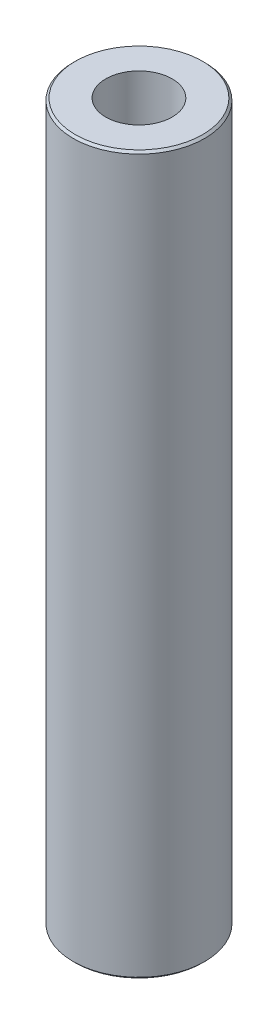
ISO-10303-21;
HEADER;
FILE_DESCRIPTION(('STEP AP214'),'2;1');
FILE_NAME('part.step','',(''),(''),'','','');
FILE_SCHEMA(('AUTOMOTIVE_DESIGN { 1 0 10303 214 1 1 1 1 }'));
ENDSEC;
DATA;
#1=APPLICATION_CONTEXT('core data for automotive mechanical design processes');
#2=APPLICATION_PROTOCOL_DEFINITION('international standard','automotive_design',2000,#1);
#3=PRODUCT_CONTEXT('',#1,'mechanical');
#4=PRODUCT('Part','Part','',(#3));
#5=PRODUCT_RELATED_PRODUCT_CATEGORY('part','',(#4));
#6=PRODUCT_DEFINITION_FORMATION('','',#4);
#7=PRODUCT_DEFINITION_CONTEXT('part definition',#1,'design');
#8=PRODUCT_DEFINITION('design','',#6,#7);
#9=PRODUCT_DEFINITION_SHAPE('','',#8);
#10=(LENGTH_UNIT() NAMED_UNIT(*) SI_UNIT(.MILLI.,.METRE.));
#11=(NAMED_UNIT(*) PLANE_ANGLE_UNIT() SI_UNIT($,.RADIAN.));
#12=(NAMED_UNIT(*) SI_UNIT($,.STERADIAN.) SOLID_ANGLE_UNIT());
#13=UNCERTAINTY_MEASURE_WITH_UNIT(LENGTH_MEASURE(1.E-05),#10,'distance_accuracy_value','');
#14=(GEOMETRIC_REPRESENTATION_CONTEXT(3) GLOBAL_UNCERTAINTY_ASSIGNED_CONTEXT((#13)) GLOBAL_UNIT_ASSIGNED_CONTEXT((#10,
#11,#12)) REPRESENTATION_CONTEXT('',''));
#15=CARTESIAN_POINT('',(0.,0.,0.));
#16=DIRECTION('',(0.,0.,1.));
#17=DIRECTION('',(1.,0.,0.));
#18=AXIS2_PLACEMENT_3D('',#15,#16,#17);
#19=CARTESIAN_POINT('',(0.,463.289840387625,0.));
#20=DIRECTION('',(0.,-1.,0.));
#21=DIRECTION('',(0.,0.,-1.));
#22=AXIS2_PLACEMENT_3D('',#19,#20,#21);
#23=CYLINDRICAL_SURFACE('',#22,42.5);
#24=CARTESIAN_POINT('',(0.,461.891525860348,0.));
#25=DIRECTION('',(0.,1.,0.));
#26=DIRECTION('',(0.,0.,1.));
#27=AXIS2_PLACEMENT_3D('',#24,#25,#26);
#28=CIRCLE('',#27,42.5);
#29=CARTESIAN_POINT('',(0.,461.891525860348,42.5));
#30=VERTEX_POINT('',#29);
#31=EDGE_CURVE('E50',#30,#30,#28,.F.);
#32=ORIENTED_EDGE('',*,*,#31,.T.);
#33=EDGE_LOOP('',(#32));
#34=FACE_BOUND('',#33,.T.);
#35=CARTESIAN_POINT('',(0.,1.39831452727668,0.));
#36=DIRECTION('',(0.,1.,0.));
#37=DIRECTION('',(0.,0.,1.));
#38=AXIS2_PLACEMENT_3D('',#35,#36,#37);
#39=CIRCLE('',#38,42.5);
#40=CARTESIAN_POINT('',(0.,1.39831452727668,42.5));
#41=VERTEX_POINT('',#40);
#42=EDGE_CURVE('E51',#41,#41,#39,.T.);
#43=ORIENTED_EDGE('',*,*,#42,.T.);
#44=EDGE_LOOP('',(#43));
#45=FACE_BOUND('',#44,.T.);
#46=ADVANCED_FACE('F39',(#34,#45),#23,.T.);
#47=CARTESIAN_POINT('',(0.,463.289840387625,0.));
#48=DIRECTION('',(0.,1.,0.));
#49=DIRECTION('',(0.,0.,1.));
#50=AXIS2_PLACEMENT_3D('',#47,#48,#49);
#51=PLANE('',#50);
#52=CARTESIAN_POINT('',(0.,463.289840387625,0.));
#53=DIRECTION('',(0.,1.,0.));
#54=DIRECTION('',(0.,0.,1.));
#55=AXIS2_PLACEMENT_3D('',#52,#53,#54);
#56=CIRCLE('',#55,41.1016854727234);
#57=CARTESIAN_POINT('',(0.,463.289840387625,41.1016854727234));
#58=VERTEX_POINT('',#57);
#59=EDGE_CURVE('E54',#58,#58,#56,.T.);
#60=ORIENTED_EDGE('',*,*,#59,.T.);
#61=EDGE_LOOP('',(#60));
#62=FACE_BOUND('',#61,.T.);
#63=CARTESIAN_POINT('',(0.,463.289840387625,0.));
#64=DIRECTION('',(0.,1.,0.));
#65=DIRECTION('',(0.,0.,1.));
#66=AXIS2_PLACEMENT_3D('',#63,#64,#65);
#67=CIRCLE('',#66,21.4343864177454);
#68=CARTESIAN_POINT('',(0.,463.289840387625,21.4343864177454));
#69=VERTEX_POINT('',#68);
#70=EDGE_CURVE('E58',#69,#69,#67,.T.);
#71=ORIENTED_EDGE('',*,*,#70,.F.);
#72=EDGE_LOOP('',(#71));
#73=FACE_BOUND('',#72,.T.);
#74=ADVANCED_FACE('F69',(#62,#73),#51,.T.);
#75=CARTESIAN_POINT('',(0.,0.,0.));
#76=DIRECTION('',(0.,1.,0.));
#77=DIRECTION('',(0.,0.,1.));
#78=AXIS2_PLACEMENT_3D('',#75,#76,#77);
#79=PLANE('',#78);
#80=CARTESIAN_POINT('',(0.,0.,0.));
#81=DIRECTION('',(0.,1.,0.));
#82=DIRECTION('',(0.,0.,1.));
#83=AXIS2_PLACEMENT_3D('',#80,#81,#82);
#84=CIRCLE('',#83,41.1016854727233);
#85=CARTESIAN_POINT('',(0.,0.,41.1016854727233));
#86=VERTEX_POINT('',#85);
#87=EDGE_CURVE('E10',#86,#86,#84,.F.);
#88=ORIENTED_EDGE('',*,*,#87,.T.);
#89=EDGE_LOOP('',(#88));
#90=FACE_BOUND('',#89,.T.);
#91=CARTESIAN_POINT('',(0.,0.,0.));
#92=DIRECTION('',(0.,1.,0.));
#93=DIRECTION('',(0.,0.,1.));
#94=AXIS2_PLACEMENT_3D('',#91,#92,#93);
#95=CIRCLE('',#94,21.4343864177454);
#96=CARTESIAN_POINT('',(0.,0.,21.4343864177454));
#97=VERTEX_POINT('',#96);
#98=EDGE_CURVE('E63',#97,#97,#95,.T.);
#99=ORIENTED_EDGE('',*,*,#98,.T.);
#100=EDGE_LOOP('',(#99));
#101=FACE_BOUND('',#100,.T.);
#102=ADVANCED_FACE('F75',(#90,#101),#79,.F.);
#103=CARTESIAN_POINT('',(0.,463.289840387625,0.));
#104=DIRECTION('',(0.,-1.,0.));
#105=DIRECTION('',(0.,0.,-1.));
#106=AXIS2_PLACEMENT_3D('',#103,#104,#105);
#107=CYLINDRICAL_SURFACE('',#106,21.4343864177454);
#108=ORIENTED_EDGE('',*,*,#70,.T.);
#109=EDGE_LOOP('',(#108));
#110=FACE_BOUND('',#109,.T.);
#111=ORIENTED_EDGE('',*,*,#98,.F.);
#112=EDGE_LOOP('',(#111));
#113=FACE_BOUND('',#112,.T.);
#114=ADVANCED_FACE('F70',(#110,#113),#107,.F.);
#115=CARTESIAN_POINT('',(0.,463.289840387625,0.));
#116=DIRECTION('',(0.,-1.,0.));
#117=DIRECTION('',(0.,0.,-1.));
#118=AXIS2_PLACEMENT_3D('',#115,#116,#117);
#119=CONICAL_SURFACE('',#118,41.1016854727234,0.785398163397438);
#120=ORIENTED_EDGE('',*,*,#31,.F.);
#121=EDGE_LOOP('',(#120));
#122=FACE_BOUND('',#121,.T.);
#123=ORIENTED_EDGE('',*,*,#59,.F.);
#124=EDGE_LOOP('',(#123));
#125=FACE_BOUND('',#124,.T.);
#126=ADVANCED_FACE('F81',(#122,#125),#119,.T.);
#127=CARTESIAN_POINT('',(0.,1.39831452727668,0.));
#128=DIRECTION('',(0.,1.,0.));
#129=DIRECTION('',(0.,0.,1.));
#130=AXIS2_PLACEMENT_3D('',#127,#128,#129);
#131=CONICAL_SURFACE('',#130,42.5,0.785398163397458);
#132=ORIENTED_EDGE('',*,*,#87,.F.);
#133=EDGE_LOOP('',(#132));
#134=FACE_BOUND('',#133,.T.);
#135=ORIENTED_EDGE('',*,*,#42,.F.);
#136=EDGE_LOOP('',(#135));
#137=FACE_BOUND('',#136,.T.);
#138=ADVANCED_FACE('F45',(#134,#137),#131,.T.);
#139=CLOSED_SHELL('',(#46,#74,#102,#114,#126,#138));
#140=MANIFOLD_SOLID_BREP('B2',#139);
#141=ADVANCED_BREP_SHAPE_REPRESENTATION('',(#18,#140),#14);
#142=SHAPE_DEFINITION_REPRESENTATION(#9,#141);
ENDSEC;
END-ISO-10303-21;
